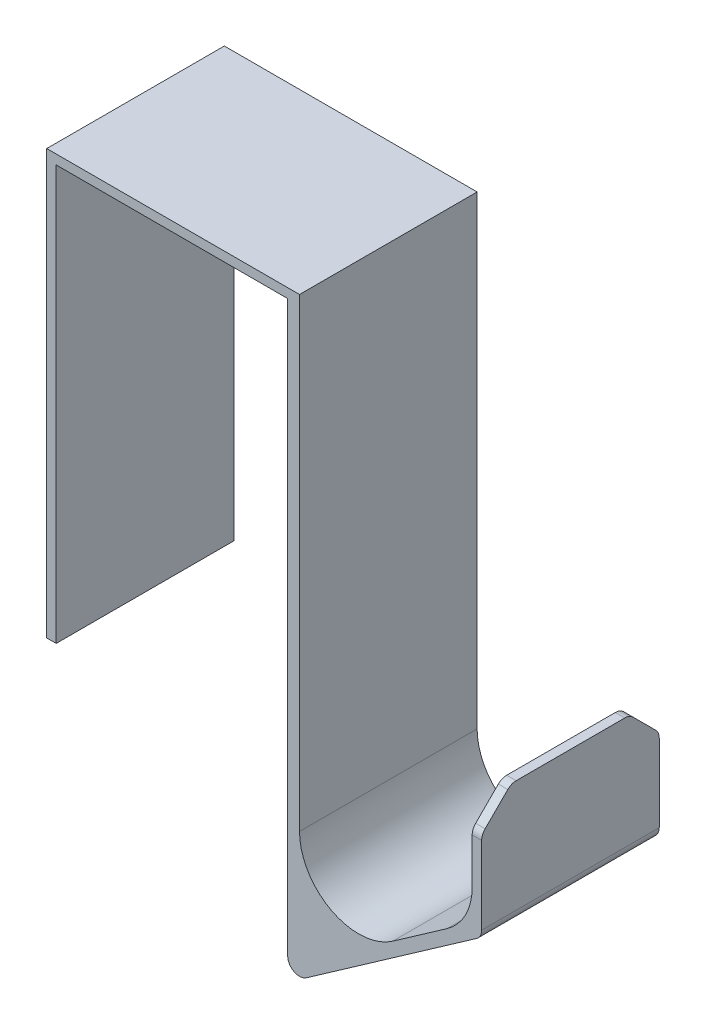
ISO-10303-21;
HEADER;
FILE_DESCRIPTION(('STEP AP214'),'2;1');
FILE_NAME('part.step','',(''),(''),'','','');
FILE_SCHEMA(('AUTOMOTIVE_DESIGN { 1 0 10303 214 1 1 1 1 }'));
ENDSEC;
DATA;
#1=APPLICATION_CONTEXT('core data for automotive mechanical design processes');
#2=APPLICATION_PROTOCOL_DEFINITION('international standard','automotive_design',2000,#1);
#3=PRODUCT_CONTEXT('',#1,'mechanical');
#4=PRODUCT('Part','Part','',(#3));
#5=PRODUCT_RELATED_PRODUCT_CATEGORY('part','',(#4));
#6=PRODUCT_DEFINITION_FORMATION('','',#4);
#7=PRODUCT_DEFINITION_CONTEXT('part definition',#1,'design');
#8=PRODUCT_DEFINITION('design','',#6,#7);
#9=PRODUCT_DEFINITION_SHAPE('','',#8);
#10=(LENGTH_UNIT() NAMED_UNIT(*) SI_UNIT(.MILLI.,.METRE.));
#11=(NAMED_UNIT(*) PLANE_ANGLE_UNIT() SI_UNIT($,.RADIAN.));
#12=(NAMED_UNIT(*) SI_UNIT($,.STERADIAN.) SOLID_ANGLE_UNIT());
#13=UNCERTAINTY_MEASURE_WITH_UNIT(LENGTH_MEASURE(1.E-05),#10,'distance_accuracy_value','');
#14=(GEOMETRIC_REPRESENTATION_CONTEXT(3) GLOBAL_UNCERTAINTY_ASSIGNED_CONTEXT((#13)) GLOBAL_UNIT_ASSIGNED_CONTEXT((#10,
#11,#12)) REPRESENTATION_CONTEXT('',''));
#15=CARTESIAN_POINT('',(0.,0.,0.));
#16=DIRECTION('',(0.,0.,1.));
#17=DIRECTION('',(1.,0.,0.));
#18=AXIS2_PLACEMENT_3D('',#15,#16,#17);
#19=CARTESIAN_POINT('',(-21.15,43.689057372,30.));
#20=DIRECTION('',(0.,1.,0.));
#21=DIRECTION('',(-1.,0.,0.));
#22=AXIS2_PLACEMENT_3D('',#19,#20,#21);
#23=PLANE('',#22);
#24=DIRECTION('',(1.,0.,0.));
#25=VECTOR('',#24,1.);
#26=CARTESIAN_POINT('',(-21.15,43.689057372,0.));
#27=LINE('',#26,#25);
#28=CARTESIAN_POINT('',(-21.15,43.689057372,0.));
#29=VERTEX_POINT('',#28);
#30=CARTESIAN_POINT('',(-19.55,43.689057372,0.));
#31=VERTEX_POINT('',#30);
#32=EDGE_CURVE('E207',#29,#31,#27,.T.);
#33=ORIENTED_EDGE('',*,*,#32,.T.);
#34=DIRECTION('',(0.,0.,-1.));
#35=VECTOR('',#34,1.);
#36=CARTESIAN_POINT('',(-19.55,43.689057372,30.));
#37=LINE('',#36,#35);
#38=CARTESIAN_POINT('',(-19.55,43.689057372,30.));
#39=VERTEX_POINT('',#38);
#40=EDGE_CURVE('E187',#39,#31,#37,.T.);
#41=ORIENTED_EDGE('',*,*,#40,.F.);
#42=DIRECTION('',(1.,0.,0.));
#43=VECTOR('',#42,1.);
#44=CARTESIAN_POINT('',(-21.15,43.689057372,30.));
#45=LINE('',#44,#43);
#46=CARTESIAN_POINT('',(-21.15,43.689057372,30.));
#47=VERTEX_POINT('',#46);
#48=EDGE_CURVE('E194',#47,#39,#45,.T.);
#49=ORIENTED_EDGE('',*,*,#48,.F.);
#50=DIRECTION('',(0.,0.,-1.));
#51=VECTOR('',#50,1.);
#52=CARTESIAN_POINT('',(-21.15,43.689057372,30.));
#53=LINE('',#52,#51);
#54=EDGE_CURVE('E332',#47,#29,#53,.T.);
#55=ORIENTED_EDGE('',*,*,#54,.T.);
#56=EDGE_LOOP('',(#33,#41,#49,#55));
#57=FACE_BOUND('',#56,.T.);
#58=ADVANCED_FACE('F35',(#57),#23,.F.);
#59=CARTESIAN_POINT('',(-19.55,43.689057372,30.));
#60=DIRECTION('',(-1.,0.,0.));
#61=DIRECTION('',(0.,0.,1.));
#62=AXIS2_PLACEMENT_3D('',#59,#60,#61);
#63=PLANE('',#62);
#64=DIRECTION('',(0.,1.,0.));
#65=VECTOR('',#64,1.);
#66=CARTESIAN_POINT('',(-19.55,43.689057372,0.));
#67=LINE('',#66,#65);
#68=CARTESIAN_POINT('',(-19.55,113.689057372,0.));
#69=VERTEX_POINT('',#68);
#70=EDGE_CURVE('E354',#31,#69,#67,.T.);
#71=ORIENTED_EDGE('',*,*,#70,.T.);
#72=DIRECTION('',(0.,0.,-1.));
#73=VECTOR('',#72,1.);
#74=CARTESIAN_POINT('',(-19.55,113.689057372,30.));
#75=LINE('',#74,#73);
#76=CARTESIAN_POINT('',(-19.55,113.689057372,30.));
#77=VERTEX_POINT('',#76);
#78=EDGE_CURVE('E190',#77,#69,#75,.T.);
#79=ORIENTED_EDGE('',*,*,#78,.F.);
#80=DIRECTION('',(0.,1.,0.));
#81=VECTOR('',#80,1.);
#82=CARTESIAN_POINT('',(-19.55,43.689057372,30.));
#83=LINE('',#82,#81);
#84=EDGE_CURVE('E183',#39,#77,#83,.T.);
#85=ORIENTED_EDGE('',*,*,#84,.F.);
#86=ORIENTED_EDGE('',*,*,#40,.T.);
#87=EDGE_LOOP('',(#71,#79,#85,#86));
#88=FACE_BOUND('',#87,.T.);
#89=ADVANCED_FACE('F185',(#88),#63,.F.);
#90=CARTESIAN_POINT('',(-19.55,113.689057372,30.));
#91=DIRECTION('',(0.,1.,0.));
#92=DIRECTION('',(0.,0.,1.));
#93=AXIS2_PLACEMENT_3D('',#90,#91,#92);
#94=PLANE('',#93);
#95=DIRECTION('',(1.,0.,0.));
#96=VECTOR('',#95,1.);
#97=CARTESIAN_POINT('',(-19.55,113.689057372,0.));
#98=LINE('',#97,#96);
#99=CARTESIAN_POINT('',(19.55,113.689057372,0.));
#100=VERTEX_POINT('',#99);
#101=EDGE_CURVE('E353',#69,#100,#98,.T.);
#102=ORIENTED_EDGE('',*,*,#101,.T.);
#103=DIRECTION('',(0.,0.,-1.));
#104=VECTOR('',#103,1.);
#105=CARTESIAN_POINT('',(19.55,113.689057372,30.));
#106=LINE('',#105,#104);
#107=CARTESIAN_POINT('',(19.55,113.689057372,30.));
#108=VERTEX_POINT('',#107);
#109=EDGE_CURVE('E212',#108,#100,#106,.T.);
#110=ORIENTED_EDGE('',*,*,#109,.F.);
#111=DIRECTION('',(1.,0.,0.));
#112=VECTOR('',#111,1.);
#113=CARTESIAN_POINT('',(-19.55,113.689057372,30.));
#114=LINE('',#113,#112);
#115=EDGE_CURVE('E193',#77,#108,#114,.T.);
#116=ORIENTED_EDGE('',*,*,#115,.F.);
#117=ORIENTED_EDGE('',*,*,#78,.T.);
#118=EDGE_LOOP('',(#102,#110,#116,#117));
#119=FACE_BOUND('',#118,.T.);
#120=ADVANCED_FACE('F371',(#119),#94,.F.);
#121=CARTESIAN_POINT('',(19.55,113.689057372,30.));
#122=DIRECTION('',(1.,0.,0.));
#123=DIRECTION('',(0.,0.,-1.));
#124=AXIS2_PLACEMENT_3D('',#121,#122,#123);
#125=PLANE('',#124);
#126=DIRECTION('',(0.,-1.,0.));
#127=VECTOR('',#126,1.);
#128=CARTESIAN_POINT('',(19.55,113.689057372,0.));
#129=LINE('',#128,#127);
#130=CARTESIAN_POINT('',(19.55,17.5310216259423,0.));
#131=VERTEX_POINT('',#130);
#132=EDGE_CURVE('E321',#100,#131,#129,.T.);
#133=ORIENTED_EDGE('',*,*,#132,.T.);
#134=DIRECTION('',(0.,0.,-1.));
#135=VECTOR('',#134,1.);
#136=CARTESIAN_POINT('',(19.55,17.5310216259423,30.));
#137=LINE('',#136,#135);
#138=CARTESIAN_POINT('',(19.55,17.5310216259423,30.));
#139=VERTEX_POINT('',#138);
#140=EDGE_CURVE('E11',#131,#139,#137,.F.);
#141=ORIENTED_EDGE('',*,*,#140,.T.);
#142=DIRECTION('',(0.,-1.,0.));
#143=VECTOR('',#142,1.);
#144=CARTESIAN_POINT('',(19.55,113.689057372,30.));
#145=LINE('',#144,#143);
#146=EDGE_CURVE('E306',#108,#139,#145,.T.);
#147=ORIENTED_EDGE('',*,*,#146,.F.);
#148=ORIENTED_EDGE('',*,*,#109,.T.);
#149=EDGE_LOOP('',(#133,#141,#147,#148));
#150=FACE_BOUND('',#149,.T.);
#151=ADVANCED_FACE('F349',(#150),#125,.F.);
#152=CARTESIAN_POINT('',(19.55,13.689057372,30.));
#153=DIRECTION('',(-0.57357643635105,0.819152044288989,0.));
#154=DIRECTION('',(-0.819152044288989,-0.57357643635105,0.));
#155=AXIS2_PLACEMENT_3D('',#152,#153,#154);
#156=PLANE('',#155);
#157=DIRECTION('',(0.819152044288989,0.57357643635105,0.));
#158=VECTOR('',#157,1.);
#159=CARTESIAN_POINT('',(19.55,13.689057372,0.));
#160=LINE('',#159,#158);
#161=CARTESIAN_POINT('',(22.6971528727021,15.8927175373644,0.));
#162=VERTEX_POINT('',#161);
#163=CARTESIAN_POINT('',(51.4632346442617,36.0349448385675,0.));
#164=VERTEX_POINT('',#163);
#165=EDGE_CURVE('E299',#162,#164,#160,.T.);
#166=ORIENTED_EDGE('',*,*,#165,.T.);
#167=DIRECTION('',(0.,0.,-1.));
#168=VECTOR('',#167,1.);
#169=CARTESIAN_POINT('',(51.4632346442617,36.0349448385675,30.));
#170=LINE('',#169,#168);
#171=CARTESIAN_POINT('',(51.4632346442617,36.0349448385675,30.));
#172=VERTEX_POINT('',#171);
#173=EDGE_CURVE('E43',#164,#172,#170,.F.);
#174=ORIENTED_EDGE('',*,*,#173,.T.);
#175=DIRECTION('',(0.819152044288989,0.57357643635105,0.));
#176=VECTOR('',#175,1.);
#177=CARTESIAN_POINT('',(19.55,13.689057372,30.));
#178=LINE('',#177,#176);
#179=CARTESIAN_POINT('',(22.6971528727021,15.8927175373644,30.));
#180=VERTEX_POINT('',#179);
#181=EDGE_CURVE('E297',#180,#172,#178,.T.);
#182=ORIENTED_EDGE('',*,*,#181,.F.);
#183=DIRECTION('',(0.,0.,-1.));
#184=VECTOR('',#183,1.);
#185=CARTESIAN_POINT('',(22.6971528727021,15.8927175373644,30.));
#186=LINE('',#185,#184);
#187=EDGE_CURVE('E290',#180,#162,#186,.T.);
#188=ORIENTED_EDGE('',*,*,#187,.T.);
#189=EDGE_LOOP('',(#166,#174,#182,#188));
#190=FACE_BOUND('',#189,.T.);
#191=ADVANCED_FACE('F296',(#190),#156,.F.);
#192=CARTESIAN_POINT('',(52.3160817715596,36.632114826042,30.));
#193=DIRECTION('',(-1.,0.,0.));
#194=DIRECTION('',(0.,0.,1.));
#195=AXIS2_PLACEMENT_3D('',#192,#193,#194);
#196=PLANE('',#195);
#197=DIRECTION('',(0.,-0.707106781186546,0.707106781186549));
#198=VECTOR('',#197,1.);
#199=CARTESIAN_POINT('',(52.3160817715596,51.632114826042,30.));
#200=LINE('',#199,#198);
#201=CARTESIAN_POINT('',(52.3160817715596,56.0463283884151,25.5857864376269));
#202=VERTEX_POINT('',#201);
#203=CARTESIAN_POINT('',(52.3160817715596,52.2179012636689,29.4142135623731));
#204=VERTEX_POINT('',#203);
#205=EDGE_CURVE('E239',#202,#204,#200,.T.);
#206=ORIENTED_EDGE('',*,*,#205,.T.);
#207=CARTESIAN_POINT('',(52.3160817715596,50.8036877012958,28.));
#208=DIRECTION('',(-1.,0.,0.));
#209=DIRECTION('',(0.,0.,1.));
#210=AXIS2_PLACEMENT_3D('',#207,#208,#209);
#211=CIRCLE('',#210,2.);
#212=CARTESIAN_POINT('',(52.3160817715596,50.8036877012958,30.));
#213=VERTEX_POINT('',#212);
#214=EDGE_CURVE('E273',#204,#213,#211,.F.);
#215=ORIENTED_EDGE('',*,*,#214,.T.);
#216=DIRECTION('',(0.,1.,0.));
#217=VECTOR('',#216,1.);
#218=CARTESIAN_POINT('',(52.3160817715596,36.632114826042,30.));
#219=LINE('',#218,#217);
#220=CARTESIAN_POINT('',(52.3160817715596,37.6732489271455,30.));
#221=VERTEX_POINT('',#220);
#222=EDGE_CURVE('E305',#221,#213,#219,.T.);
#223=ORIENTED_EDGE('',*,*,#222,.F.);
#224=DIRECTION('',(0.,0.,-1.));
#225=VECTOR('',#224,1.);
#226=CARTESIAN_POINT('',(52.3160817715596,37.6732489271455,30.));
#227=LINE('',#226,#225);
#228=CARTESIAN_POINT('',(52.3160817715596,37.6732489271455,0.));
#229=VERTEX_POINT('',#228);
#230=EDGE_CURVE('E264',#221,#229,#227,.T.);
#231=ORIENTED_EDGE('',*,*,#230,.T.);
#232=DIRECTION('',(0.,1.,0.));
#233=VECTOR('',#232,1.);
#234=CARTESIAN_POINT('',(52.3160817715596,36.632114826042,0.));
#235=LINE('',#234,#233);
#236=CARTESIAN_POINT('',(52.3160817715596,50.8036877012958,0.));
#237=VERTEX_POINT('',#236);
#238=EDGE_CURVE('E313',#229,#237,#235,.T.);
#239=ORIENTED_EDGE('',*,*,#238,.T.);
#240=CARTESIAN_POINT('',(52.3160817715596,50.8036877012958,2.));
#241=DIRECTION('',(-1.,0.,0.));
#242=DIRECTION('',(0.,0.,1.));
#243=AXIS2_PLACEMENT_3D('',#240,#241,#242);
#244=CIRCLE('',#243,2.);
#245=CARTESIAN_POINT('',(52.3160817715596,52.2179012636689,0.585786437626903));
#246=VERTEX_POINT('',#245);
#247=EDGE_CURVE('E271',#237,#246,#244,.F.);
#248=ORIENTED_EDGE('',*,*,#247,.T.);
#249=DIRECTION('',(0.,-0.707106781186549,-0.707106781186547));
#250=VECTOR('',#249,1.);
#251=CARTESIAN_POINT('',(52.3160817715596,56.632114826042,4.99999999999999));
#252=LINE('',#251,#250);
#253=CARTESIAN_POINT('',(52.3160817715596,56.0463283884151,4.41421356237308));
#254=VERTEX_POINT('',#253);
#255=EDGE_CURVE('E242',#246,#254,#252,.F.);
#256=ORIENTED_EDGE('',*,*,#255,.T.);
#257=CARTESIAN_POINT('',(52.3160817715596,54.632114826042,5.82842712474618));
#258=DIRECTION('',(-1.,0.,0.));
#259=DIRECTION('',(0.,0.,1.));
#260=AXIS2_PLACEMENT_3D('',#257,#258,#259);
#261=CIRCLE('',#260,2.);
#262=CARTESIAN_POINT('',(52.3160817715596,56.632114826042,5.82842712474618));
#263=VERTEX_POINT('',#262);
#264=EDGE_CURVE('E269',#254,#263,#261,.F.);
#265=ORIENTED_EDGE('',*,*,#264,.T.);
#266=DIRECTION('',(0.,0.,-1.));
#267=VECTOR('',#266,1.);
#268=CARTESIAN_POINT('',(52.3160817715596,56.632114826042,30.));
#269=LINE('',#268,#267);
#270=CARTESIAN_POINT('',(52.3160817715596,56.632114826042,24.1715728752538));
#271=VERTEX_POINT('',#270);
#272=EDGE_CURVE('E343',#271,#263,#269,.T.);
#273=ORIENTED_EDGE('',*,*,#272,.F.);
#274=CARTESIAN_POINT('',(52.3160817715596,54.632114826042,24.1715728752538));
#275=DIRECTION('',(-1.,0.,0.));
#276=DIRECTION('',(0.,0.,1.));
#277=AXIS2_PLACEMENT_3D('',#274,#275,#276);
#278=CIRCLE('',#277,2.);
#279=EDGE_CURVE('E267',#271,#202,#278,.F.);
#280=ORIENTED_EDGE('',*,*,#279,.T.);
#281=EDGE_LOOP('',(#206,#215,#223,#231,#239,#248,#256,#265,#273,#280));
#282=FACE_BOUND('',#281,.T.);
#283=ADVANCED_FACE('F312',(#282),#196,.F.);
#284=CARTESIAN_POINT('',(50.7160817715596,56.632114826042,30.));
#285=DIRECTION('',(0.,-1.,0.));
#286=DIRECTION('',(0.,0.,-1.));
#287=AXIS2_PLACEMENT_3D('',#284,#285,#286);
#288=PLANE('',#287);
#289=ORIENTED_EDGE('',*,*,#272,.T.);
#290=DIRECTION('',(1.,0.,0.));
#291=VECTOR('',#290,1.);
#292=CARTESIAN_POINT('',(50.7160817715596,56.632114826042,5.82842712474618));
#293=LINE('',#292,#291);
#294=CARTESIAN_POINT('',(50.7160817715596,56.632114826042,5.82842712474618));
#295=VERTEX_POINT('',#294);
#296=EDGE_CURVE('E287',#263,#295,#293,.F.);
#297=ORIENTED_EDGE('',*,*,#296,.T.);
#298=DIRECTION('',(0.,0.,-1.));
#299=VECTOR('',#298,1.);
#300=CARTESIAN_POINT('',(50.7160817715596,56.632114826042,30.));
#301=LINE('',#300,#299);
#302=CARTESIAN_POINT('',(50.7160817715596,56.632114826042,24.1715728752538));
#303=VERTEX_POINT('',#302);
#304=EDGE_CURVE('E340',#303,#295,#301,.T.);
#305=ORIENTED_EDGE('',*,*,#304,.F.);
#306=DIRECTION('',(1.,0.,0.));
#307=VECTOR('',#306,1.);
#308=CARTESIAN_POINT('',(52.3160817715596,56.632114826042,24.1715728752538));
#309=LINE('',#308,#307);
#310=EDGE_CURVE('E284',#303,#271,#309,.T.);
#311=ORIENTED_EDGE('',*,*,#310,.T.);
#312=EDGE_LOOP('',(#289,#297,#305,#311));
#313=FACE_BOUND('',#312,.T.);
#314=ADVANCED_FACE('F501',(#313),#288,.F.);
#315=CARTESIAN_POINT('',(50.7160817715596,37.9533319424294,30.));
#316=DIRECTION('',(1.,0.,0.));
#317=DIRECTION('',(0.,0.,-1.));
#318=AXIS2_PLACEMENT_3D('',#315,#316,#317);
#319=PLANE('',#318);
#320=DIRECTION('',(0.,-1.,0.));
#321=VECTOR('',#320,1.);
#322=CARTESIAN_POINT('',(50.7160817715596,37.9533319424294,30.));
#323=LINE('',#322,#321);
#324=CARTESIAN_POINT('',(50.7160817715596,50.8036877012958,30.));
#325=VERTEX_POINT('',#324);
#326=CARTESIAN_POINT('',(50.7160817715596,43.1590024479468,30.));
#327=VERTEX_POINT('',#326);
#328=EDGE_CURVE('E367',#325,#327,#323,.T.);
#329=ORIENTED_EDGE('',*,*,#328,.F.);
#330=CARTESIAN_POINT('',(50.7160817715596,50.8036877012958,28.));
#331=DIRECTION('',(1.,0.,0.));
#332=DIRECTION('',(0.,0.,-1.));
#333=AXIS2_PLACEMENT_3D('',#330,#331,#332);
#334=CIRCLE('',#333,2.);
#335=CARTESIAN_POINT('',(50.7160817715596,52.2179012636689,29.4142135623731));
#336=VERTEX_POINT('',#335);
#337=EDGE_CURVE('E258',#325,#336,#334,.F.);
#338=ORIENTED_EDGE('',*,*,#337,.T.);
#339=DIRECTION('',(0.,0.707106781186546,-0.707106781186549));
#340=VECTOR('',#339,1.);
#341=CARTESIAN_POINT('',(50.7160817715596,51.632114826042,30.));
#342=LINE('',#341,#340);
#343=CARTESIAN_POINT('',(50.7160817715596,56.0463283884151,25.5857864376269));
#344=VERTEX_POINT('',#343);
#345=EDGE_CURVE('E233',#336,#344,#342,.T.);
#346=ORIENTED_EDGE('',*,*,#345,.T.);
#347=CARTESIAN_POINT('',(50.7160817715596,54.632114826042,24.1715728752538));
#348=DIRECTION('',(1.,0.,0.));
#349=DIRECTION('',(0.,0.,-1.));
#350=AXIS2_PLACEMENT_3D('',#347,#348,#349);
#351=CIRCLE('',#350,2.);
#352=EDGE_CURVE('E252',#344,#303,#351,.F.);
#353=ORIENTED_EDGE('',*,*,#352,.T.);
#354=ORIENTED_EDGE('',*,*,#304,.T.);
#355=CARTESIAN_POINT('',(50.7160817715596,54.632114826042,5.82842712474618));
#356=DIRECTION('',(1.,0.,0.));
#357=DIRECTION('',(0.,0.,-1.));
#358=AXIS2_PLACEMENT_3D('',#355,#356,#357);
#359=CIRCLE('',#358,2.);
#360=CARTESIAN_POINT('',(50.7160817715596,56.0463283884151,4.41421356237308));
#361=VERTEX_POINT('',#360);
#362=EDGE_CURVE('E254',#295,#361,#359,.F.);
#363=ORIENTED_EDGE('',*,*,#362,.T.);
#364=DIRECTION('',(0.,0.707106781186549,0.707106781186547));
#365=VECTOR('',#364,1.);
#366=CARTESIAN_POINT('',(50.7160817715596,56.632114826042,4.99999999999999));
#367=LINE('',#366,#365);
#368=CARTESIAN_POINT('',(50.7160817715596,52.2179012636689,0.585786437626903));
#369=VERTEX_POINT('',#368);
#370=EDGE_CURVE('E236',#361,#369,#367,.F.);
#371=ORIENTED_EDGE('',*,*,#370,.T.);
#372=CARTESIAN_POINT('',(50.7160817715596,50.8036877012958,2.));
#373=DIRECTION('',(1.,0.,0.));
#374=DIRECTION('',(0.,0.,-1.));
#375=AXIS2_PLACEMENT_3D('',#372,#373,#374);
#376=CIRCLE('',#375,2.);
#377=CARTESIAN_POINT('',(50.7160817715596,50.8036877012958,0.));
#378=VERTEX_POINT('',#377);
#379=EDGE_CURVE('E256',#369,#378,#376,.F.);
#380=ORIENTED_EDGE('',*,*,#379,.T.);
#381=DIRECTION('',(0.,-1.,0.));
#382=VECTOR('',#381,1.);
#383=CARTESIAN_POINT('',(50.7160817715596,37.9533319424294,0.));
#384=LINE('',#383,#382);
#385=CARTESIAN_POINT('',(50.7160817715596,43.1590024479468,0.));
#386=VERTEX_POINT('',#385);
#387=EDGE_CURVE('E317',#378,#386,#384,.T.);
#388=ORIENTED_EDGE('',*,*,#387,.T.);
#389=DIRECTION('',(0.,0.,-1.));
#390=VECTOR('',#389,1.);
#391=CARTESIAN_POINT('',(50.7160817715596,43.1590024479468,30.));
#392=LINE('',#391,#390);
#393=EDGE_CURVE('E218',#386,#327,#392,.F.);
#394=ORIENTED_EDGE('',*,*,#393,.T.);
#395=EDGE_LOOP('',(#329,#338,#346,#353,#354,#363,#371,#380,#388,#394));
#396=FACE_BOUND('',#395,.T.);
#397=ADVANCED_FACE('F495',(#396),#319,.F.);
#398=CARTESIAN_POINT('',(21.55,17.5310216259423,30.));
#399=DIRECTION('',(0.57357643635105,-0.819152044288989,0.));
#400=DIRECTION('',(0.819152044288989,0.57357643635105,0.));
#401=AXIS2_PLACEMENT_3D('',#398,#399,#400);
#402=PLANE('',#401);
#403=DIRECTION('',(-0.819152044288989,-0.57357643635105,0.));
#404=VECTOR('',#403,1.);
#405=CARTESIAN_POINT('',(21.55,17.5310216259423,30.));
#406=LINE('',#405,#404);
#407=CARTESIAN_POINT('',(46.4518461350701,34.9674820050569,30.));
#408=VERTEX_POINT('',#407);
#409=CARTESIAN_POINT('',(37.2857643635105,28.5493224527642,30.));
#410=VERTEX_POINT('',#409);
#411=EDGE_CURVE('E364',#408,#410,#406,.T.);
#412=ORIENTED_EDGE('',*,*,#411,.F.);
#413=DIRECTION('',(0.,0.,-1.));
#414=VECTOR('',#413,1.);
#415=CARTESIAN_POINT('',(46.4518461350701,34.9674820050569,0.));
#416=LINE('',#415,#414);
#417=CARTESIAN_POINT('',(46.4518461350701,34.9674820050569,0.));
#418=VERTEX_POINT('',#417);
#419=EDGE_CURVE('E210',#408,#418,#416,.T.);
#420=ORIENTED_EDGE('',*,*,#419,.T.);
#421=DIRECTION('',(-0.819152044288989,-0.57357643635105,0.));
#422=VECTOR('',#421,1.);
#423=CARTESIAN_POINT('',(21.55,17.5310216259423,0.));
#424=LINE('',#423,#422);
#425=CARTESIAN_POINT('',(37.2857643635105,28.5493224527642,0.));
#426=VERTEX_POINT('',#425);
#427=EDGE_CURVE('E319',#418,#426,#424,.T.);
#428=ORIENTED_EDGE('',*,*,#427,.T.);
#429=DIRECTION('',(0.,0.,-1.));
#430=VECTOR('',#429,1.);
#431=CARTESIAN_POINT('',(37.2857643635105,28.5493224527642,30.));
#432=LINE('',#431,#430);
#433=EDGE_CURVE('E208',#426,#410,#432,.F.);
#434=ORIENTED_EDGE('',*,*,#433,.T.);
#435=EDGE_LOOP('',(#412,#420,#428,#434));
#436=FACE_BOUND('',#435,.T.);
#437=ADVANCED_FACE('F500',(#436),#402,.F.);
#438=CARTESIAN_POINT('',(21.55,115.289057372,30.));
#439=DIRECTION('',(-1.,0.,0.));
#440=DIRECTION('',(0.,-1.,0.));
#441=AXIS2_PLACEMENT_3D('',#438,#439,#440);
#442=PLANE('',#441);
#443=DIRECTION('',(0.,1.,0.));
#444=VECTOR('',#443,1.);
#445=CARTESIAN_POINT('',(21.55,115.289057372,30.));
#446=LINE('',#445,#444);
#447=CARTESIAN_POINT('',(21.55,36.7408428956541,30.));
#448=VERTEX_POINT('',#447);
#449=CARTESIAN_POINT('',(21.55,115.289057372,30.));
#450=VERTEX_POINT('',#449);
#451=EDGE_CURVE('E362',#448,#450,#446,.T.);
#452=ORIENTED_EDGE('',*,*,#451,.F.);
#453=DIRECTION('',(0.,0.,-1.));
#454=VECTOR('',#453,1.);
#455=CARTESIAN_POINT('',(21.55,36.7408428956541,0.));
#456=LINE('',#455,#454);
#457=CARTESIAN_POINT('',(21.55,36.7408428956541,0.));
#458=VERTEX_POINT('',#457);
#459=EDGE_CURVE('E221',#448,#458,#456,.T.);
#460=ORIENTED_EDGE('',*,*,#459,.T.);
#461=DIRECTION('',(0.,1.,0.));
#462=VECTOR('',#461,1.);
#463=CARTESIAN_POINT('',(21.55,115.289057372,0.));
#464=LINE('',#463,#462);
#465=CARTESIAN_POINT('',(21.55,115.289057372,0.));
#466=VERTEX_POINT('',#465);
#467=EDGE_CURVE('E327',#458,#466,#464,.T.);
#468=ORIENTED_EDGE('',*,*,#467,.T.);
#469=DIRECTION('',(0.,0.,-1.));
#470=VECTOR('',#469,1.);
#471=CARTESIAN_POINT('',(21.55,115.289057372,30.));
#472=LINE('',#471,#470);
#473=EDGE_CURVE('E337',#450,#466,#472,.T.);
#474=ORIENTED_EDGE('',*,*,#473,.F.);
#475=EDGE_LOOP('',(#452,#460,#468,#474));
#476=FACE_BOUND('',#475,.T.);
#477=ADVANCED_FACE('F551',(#476),#442,.F.);
#478=CARTESIAN_POINT('',(-21.15,115.289057372,30.));
#479=DIRECTION('',(0.,-1.,0.));
#480=DIRECTION('',(0.,0.,-1.));
#481=AXIS2_PLACEMENT_3D('',#478,#479,#480);
#482=PLANE('',#481);
#483=DIRECTION('',(-1.,0.,0.));
#484=VECTOR('',#483,1.);
#485=CARTESIAN_POINT('',(-21.15,115.289057372,0.));
#486=LINE('',#485,#484);
#487=CARTESIAN_POINT('',(-21.15,115.289057372,0.));
#488=VERTEX_POINT('',#487);
#489=EDGE_CURVE('E329',#466,#488,#486,.T.);
#490=ORIENTED_EDGE('',*,*,#489,.T.);
#491=DIRECTION('',(0.,0.,-1.));
#492=VECTOR('',#491,1.);
#493=CARTESIAN_POINT('',(-21.15,115.289057372,30.));
#494=LINE('',#493,#492);
#495=CARTESIAN_POINT('',(-21.15,115.289057372,30.));
#496=VERTEX_POINT('',#495);
#497=EDGE_CURVE('E334',#496,#488,#494,.T.);
#498=ORIENTED_EDGE('',*,*,#497,.F.);
#499=DIRECTION('',(-1.,0.,0.));
#500=VECTOR('',#499,1.);
#501=CARTESIAN_POINT('',(-21.15,115.289057372,30.));
#502=LINE('',#501,#500);
#503=EDGE_CURVE('E360',#450,#496,#502,.T.);
#504=ORIENTED_EDGE('',*,*,#503,.F.);
#505=ORIENTED_EDGE('',*,*,#473,.T.);
#506=EDGE_LOOP('',(#490,#498,#504,#505));
#507=FACE_BOUND('',#506,.T.);
#508=ADVANCED_FACE('F556',(#507),#482,.F.);
#509=CARTESIAN_POINT('',(-21.15,43.689057372,30.));
#510=DIRECTION('',(1.,0.,0.));
#511=DIRECTION('',(0.,0.,-1.));
#512=AXIS2_PLACEMENT_3D('',#509,#510,#511);
#513=PLANE('',#512);
#514=DIRECTION('',(0.,-1.,0.));
#515=VECTOR('',#514,1.);
#516=CARTESIAN_POINT('',(-21.15,43.689057372,0.));
#517=LINE('',#516,#515);
#518=EDGE_CURVE('E204',#488,#29,#517,.T.);
#519=ORIENTED_EDGE('',*,*,#518,.T.);
#520=ORIENTED_EDGE('',*,*,#54,.F.);
#521=DIRECTION('',(0.,-1.,0.));
#522=VECTOR('',#521,1.);
#523=CARTESIAN_POINT('',(-21.15,43.689057372,30.));
#524=LINE('',#523,#522);
#525=EDGE_CURVE('E200',#496,#47,#524,.T.);
#526=ORIENTED_EDGE('',*,*,#525,.F.);
#527=ORIENTED_EDGE('',*,*,#497,.T.);
#528=EDGE_LOOP('',(#519,#520,#526,#527));
#529=FACE_BOUND('',#528,.T.);
#530=ADVANCED_FACE('F488',(#529),#513,.F.);
#531=CARTESIAN_POINT('',(0.,0.,30.));
#532=DIRECTION('',(0.,0.,1.));
#533=DIRECTION('',(1.,0.,0.));
#534=AXIS2_PLACEMENT_3D('',#531,#532,#533);
#535=PLANE('',#534);
#536=ORIENTED_EDGE('',*,*,#222,.T.);
#537=DIRECTION('',(-1.,0.,0.));
#538=VECTOR('',#537,1.);
#539=CARTESIAN_POINT('',(0.,50.8036877012958,30.));
#540=LINE('',#539,#538);
#541=EDGE_CURVE('E249',#213,#325,#540,.T.);
#542=ORIENTED_EDGE('',*,*,#541,.T.);
#543=ORIENTED_EDGE('',*,*,#328,.T.);
#544=CARTESIAN_POINT('',(40.7160817715596,43.1590024479468,30.));
#545=DIRECTION('',(0.,0.,1.));
#546=DIRECTION('',(1.,0.,0.));
#547=AXIS2_PLACEMENT_3D('',#544,#545,#546);
#548=CIRCLE('',#547,10.);
#549=EDGE_CURVE('E227',#327,#408,#548,.F.);
#550=ORIENTED_EDGE('',*,*,#549,.T.);
#551=ORIENTED_EDGE('',*,*,#411,.T.);
#552=CARTESIAN_POINT('',(31.55,36.7408428956541,30.));
#553=DIRECTION('',(0.,0.,1.));
#554=DIRECTION('',(1.,0.,0.));
#555=AXIS2_PLACEMENT_3D('',#552,#553,#554);
#556=CIRCLE('',#555,10.);
#557=EDGE_CURVE('E231',#410,#448,#556,.F.);
#558=ORIENTED_EDGE('',*,*,#557,.T.);
#559=ORIENTED_EDGE('',*,*,#451,.T.);
#560=ORIENTED_EDGE('',*,*,#503,.T.);
#561=ORIENTED_EDGE('',*,*,#525,.T.);
#562=ORIENTED_EDGE('',*,*,#48,.T.);
#563=ORIENTED_EDGE('',*,*,#84,.T.);
#564=ORIENTED_EDGE('',*,*,#115,.T.);
#565=ORIENTED_EDGE('',*,*,#146,.T.);
#566=CARTESIAN_POINT('',(21.55,17.5310216259423,30.));
#567=DIRECTION('',(0.,0.,1.));
#568=DIRECTION('',(1.,0.,0.));
#569=AXIS2_PLACEMENT_3D('',#566,#567,#568);
#570=CIRCLE('',#569,2.);
#571=EDGE_CURVE('E245',#139,#180,#570,.T.);
#572=ORIENTED_EDGE('',*,*,#571,.T.);
#573=ORIENTED_EDGE('',*,*,#181,.T.);
#574=CARTESIAN_POINT('',(50.3160817715596,37.6732489271455,30.));
#575=DIRECTION('',(0.,0.,1.));
#576=DIRECTION('',(1.,0.,0.));
#577=AXIS2_PLACEMENT_3D('',#574,#575,#576);
#578=CIRCLE('',#577,2.);
#579=EDGE_CURVE('E247',#172,#221,#578,.T.);
#580=ORIENTED_EDGE('',*,*,#579,.T.);
#581=EDGE_LOOP('',(#536,#542,#543,#550,#551,#558,#559,#560,#561,#562,#563,#564,#565,#572,#573,#580));
#582=FACE_BOUND('',#581,.T.);
#583=ADVANCED_FACE('F198',(#582),#535,.T.);
#584=CARTESIAN_POINT('',(0.,0.,0.));
#585=DIRECTION('',(0.,0.,1.));
#586=DIRECTION('',(1.,0.,0.));
#587=AXIS2_PLACEMENT_3D('',#584,#585,#586);
#588=PLANE('',#587);
#589=ORIENTED_EDGE('',*,*,#387,.F.);
#590=DIRECTION('',(-1.,0.,0.));
#591=VECTOR('',#590,1.);
#592=CARTESIAN_POINT('',(52.3160817715596,50.8036877012958,0.));
#593=LINE('',#592,#591);
#594=EDGE_CURVE('E277',#378,#237,#593,.F.);
#595=ORIENTED_EDGE('',*,*,#594,.T.);
#596=ORIENTED_EDGE('',*,*,#238,.F.);
#597=CARTESIAN_POINT('',(50.3160817715596,37.6732489271455,0.));
#598=DIRECTION('',(0.,0.,1.));
#599=DIRECTION('',(1.,0.,0.));
#600=AXIS2_PLACEMENT_3D('',#597,#598,#599);
#601=CIRCLE('',#600,2.);
#602=EDGE_CURVE('E56',#229,#164,#601,.F.);
#603=ORIENTED_EDGE('',*,*,#602,.T.);
#604=ORIENTED_EDGE('',*,*,#165,.F.);
#605=CARTESIAN_POINT('',(21.55,17.5310216259423,0.));
#606=DIRECTION('',(0.,0.,1.));
#607=DIRECTION('',(1.,0.,0.));
#608=AXIS2_PLACEMENT_3D('',#605,#606,#607);
#609=CIRCLE('',#608,2.);
#610=EDGE_CURVE('E50',#162,#131,#609,.F.);
#611=ORIENTED_EDGE('',*,*,#610,.T.);
#612=ORIENTED_EDGE('',*,*,#132,.F.);
#613=ORIENTED_EDGE('',*,*,#101,.F.);
#614=ORIENTED_EDGE('',*,*,#70,.F.);
#615=ORIENTED_EDGE('',*,*,#32,.F.);
#616=ORIENTED_EDGE('',*,*,#518,.F.);
#617=ORIENTED_EDGE('',*,*,#489,.F.);
#618=ORIENTED_EDGE('',*,*,#467,.F.);
#619=CARTESIAN_POINT('',(31.55,36.7408428956541,0.));
#620=DIRECTION('',(0.,0.,1.));
#621=DIRECTION('',(1.,0.,0.));
#622=AXIS2_PLACEMENT_3D('',#619,#620,#621);
#623=CIRCLE('',#622,10.);
#624=EDGE_CURVE('E229',#458,#426,#623,.T.);
#625=ORIENTED_EDGE('',*,*,#624,.T.);
#626=ORIENTED_EDGE('',*,*,#427,.F.);
#627=CARTESIAN_POINT('',(40.7160817715596,43.1590024479468,0.));
#628=DIRECTION('',(0.,0.,1.));
#629=DIRECTION('',(1.,0.,0.));
#630=AXIS2_PLACEMENT_3D('',#627,#628,#629);
#631=CIRCLE('',#630,10.);
#632=EDGE_CURVE('E224',#418,#386,#631,.T.);
#633=ORIENTED_EDGE('',*,*,#632,.T.);
#634=EDGE_LOOP('',(#589,#595,#596,#603,#604,#611,#612,#613,#614,#615,#616,#617,#618,#625,#626,#633));
#635=FACE_BOUND('',#634,.T.);
#636=ADVANCED_FACE('F315',(#635),#588,.F.);
#637=CARTESIAN_POINT('',(40.7160817715596,43.1590024479468,30.));
#638=DIRECTION('',(0.,0.,1.));
#639=DIRECTION('',(1.,0.,0.));
#640=AXIS2_PLACEMENT_3D('',#637,#638,#639);
#641=CYLINDRICAL_SURFACE('',#640,10.);
#642=ORIENTED_EDGE('',*,*,#549,.F.);
#643=ORIENTED_EDGE('',*,*,#393,.F.);
#644=ORIENTED_EDGE('',*,*,#632,.F.);
#645=ORIENTED_EDGE('',*,*,#419,.F.);
#646=EDGE_LOOP('',(#642,#643,#644,#645));
#647=FACE_BOUND('',#646,.T.);
#648=ADVANCED_FACE('F385',(#647),#641,.F.);
#649=CARTESIAN_POINT('',(31.55,36.7408428956541,30.));
#650=DIRECTION('',(0.,0.,1.));
#651=DIRECTION('',(1.,0.,0.));
#652=AXIS2_PLACEMENT_3D('',#649,#650,#651);
#653=CYLINDRICAL_SURFACE('',#652,10.);
#654=ORIENTED_EDGE('',*,*,#557,.F.);
#655=ORIENTED_EDGE('',*,*,#433,.F.);
#656=ORIENTED_EDGE('',*,*,#624,.F.);
#657=ORIENTED_EDGE('',*,*,#459,.F.);
#658=EDGE_LOOP('',(#654,#655,#656,#657));
#659=FACE_BOUND('',#658,.T.);
#660=ADVANCED_FACE('F388',(#659),#653,.F.);
#661=CARTESIAN_POINT('',(50.7160817715596,56.632114826042,4.99999999999999));
#662=DIRECTION('',(0.,-0.707106781186546,0.707106781186548));
#663=DIRECTION('',(-1.,0.,0.));
#664=AXIS2_PLACEMENT_3D('',#661,#662,#663);
#665=PLANE('',#664);
#666=ORIENTED_EDGE('',*,*,#255,.F.);
#667=DIRECTION('',(1.,0.,0.));
#668=VECTOR('',#667,1.);
#669=CARTESIAN_POINT('',(50.7160817715596,52.2179012636689,0.585786437626905));
#670=LINE('',#669,#668);
#671=EDGE_CURVE('E282',#246,#369,#670,.F.);
#672=ORIENTED_EDGE('',*,*,#671,.T.);
#673=ORIENTED_EDGE('',*,*,#370,.F.);
#674=DIRECTION('',(-1.,0.,0.));
#675=VECTOR('',#674,1.);
#676=CARTESIAN_POINT('',(52.3160817715596,56.0463283884151,4.41421356237308));
#677=LINE('',#676,#675);
#678=EDGE_CURVE('E280',#361,#254,#677,.F.);
#679=ORIENTED_EDGE('',*,*,#678,.T.);
#680=EDGE_LOOP('',(#666,#672,#673,#679));
#681=FACE_BOUND('',#680,.T.);
#682=ADVANCED_FACE('F392',(#681),#665,.F.);
#683=CARTESIAN_POINT('',(0.,51.632114826042,30.));
#684=DIRECTION('',(0.,0.707106781186549,0.707106781186545));
#685=DIRECTION('',(1.,0.,0.));
#686=AXIS2_PLACEMENT_3D('',#683,#684,#685);
#687=PLANE('',#686);
#688=ORIENTED_EDGE('',*,*,#345,.F.);
#689=DIRECTION('',(-1.,0.,0.));
#690=VECTOR('',#689,1.);
#691=CARTESIAN_POINT('',(0.,52.2179012636689,29.4142135623731));
#692=LINE('',#691,#690);
#693=EDGE_CURVE('E262',#336,#204,#692,.F.);
#694=ORIENTED_EDGE('',*,*,#693,.T.);
#695=ORIENTED_EDGE('',*,*,#205,.F.);
#696=DIRECTION('',(1.,0.,0.));
#697=VECTOR('',#696,1.);
#698=CARTESIAN_POINT('',(50.7160817715596,56.0463283884151,25.5857864376269));
#699=LINE('',#698,#697);
#700=EDGE_CURVE('E260',#202,#344,#699,.F.);
#701=ORIENTED_EDGE('',*,*,#700,.T.);
#702=EDGE_LOOP('',(#688,#694,#695,#701));
#703=FACE_BOUND('',#702,.T.);
#704=ADVANCED_FACE('F400',(#703),#687,.T.);
#705=CARTESIAN_POINT('',(0.,50.8036877012958,28.));
#706=DIRECTION('',(-1.,0.,0.));
#707=DIRECTION('',(0.,0.,1.));
#708=AXIS2_PLACEMENT_3D('',#705,#706,#707);
#709=CYLINDRICAL_SURFACE('',#708,2.);
#710=ORIENTED_EDGE('',*,*,#214,.F.);
#711=ORIENTED_EDGE('',*,*,#693,.F.);
#712=ORIENTED_EDGE('',*,*,#337,.F.);
#713=ORIENTED_EDGE('',*,*,#541,.F.);
#714=EDGE_LOOP('',(#710,#711,#712,#713));
#715=FACE_BOUND('',#714,.T.);
#716=ADVANCED_FACE('F406',(#715),#709,.T.);
#717=CARTESIAN_POINT('',(0.,50.8036877012958,2.));
#718=DIRECTION('',(1.,0.,0.));
#719=DIRECTION('',(0.,0.,-1.));
#720=AXIS2_PLACEMENT_3D('',#717,#718,#719);
#721=CYLINDRICAL_SURFACE('',#720,2.);
#722=ORIENTED_EDGE('',*,*,#379,.F.);
#723=ORIENTED_EDGE('',*,*,#671,.F.);
#724=ORIENTED_EDGE('',*,*,#247,.F.);
#725=ORIENTED_EDGE('',*,*,#594,.F.);
#726=EDGE_LOOP('',(#722,#723,#724,#725));
#727=FACE_BOUND('',#726,.T.);
#728=ADVANCED_FACE('F410',(#727),#721,.T.);
#729=CARTESIAN_POINT('',(50.7160817715596,54.632114826042,5.82842712474618));
#730=DIRECTION('',(-1.,0.,0.));
#731=DIRECTION('',(0.,0.,1.));
#732=AXIS2_PLACEMENT_3D('',#729,#730,#731);
#733=CYLINDRICAL_SURFACE('',#732,2.);
#734=ORIENTED_EDGE('',*,*,#264,.F.);
#735=ORIENTED_EDGE('',*,*,#678,.F.);
#736=ORIENTED_EDGE('',*,*,#362,.F.);
#737=ORIENTED_EDGE('',*,*,#296,.F.);
#738=EDGE_LOOP('',(#734,#735,#736,#737));
#739=FACE_BOUND('',#738,.T.);
#740=ADVANCED_FACE('F414',(#739),#733,.T.);
#741=CARTESIAN_POINT('',(50.7160817715596,54.632114826042,24.1715728752538));
#742=DIRECTION('',(-1.,0.,0.));
#743=DIRECTION('',(0.,0.,1.));
#744=AXIS2_PLACEMENT_3D('',#741,#742,#743);
#745=CYLINDRICAL_SURFACE('',#744,2.);
#746=ORIENTED_EDGE('',*,*,#352,.F.);
#747=ORIENTED_EDGE('',*,*,#700,.F.);
#748=ORIENTED_EDGE('',*,*,#279,.F.);
#749=ORIENTED_EDGE('',*,*,#310,.F.);
#750=EDGE_LOOP('',(#746,#747,#748,#749));
#751=FACE_BOUND('',#750,.T.);
#752=ADVANCED_FACE('F418',(#751),#745,.T.);
#753=CARTESIAN_POINT('',(50.3160817715596,37.6732489271455,30.));
#754=DIRECTION('',(0.,0.,-1.));
#755=DIRECTION('',(-1.,0.,0.));
#756=AXIS2_PLACEMENT_3D('',#753,#754,#755);
#757=CYLINDRICAL_SURFACE('',#756,2.);
#758=ORIENTED_EDGE('',*,*,#579,.F.);
#759=ORIENTED_EDGE('',*,*,#173,.F.);
#760=ORIENTED_EDGE('',*,*,#602,.F.);
#761=ORIENTED_EDGE('',*,*,#230,.F.);
#762=EDGE_LOOP('',(#758,#759,#760,#761));
#763=FACE_BOUND('',#762,.T.);
#764=ADVANCED_FACE('F309',(#763),#757,.T.);
#765=CARTESIAN_POINT('',(21.55,17.5310216259423,30.));
#766=DIRECTION('',(0.,0.,-1.));
#767=DIRECTION('',(-1.,0.,0.));
#768=AXIS2_PLACEMENT_3D('',#765,#766,#767);
#769=CYLINDRICAL_SURFACE('',#768,2.);
#770=ORIENTED_EDGE('',*,*,#571,.F.);
#771=ORIENTED_EDGE('',*,*,#140,.F.);
#772=ORIENTED_EDGE('',*,*,#610,.F.);
#773=ORIENTED_EDGE('',*,*,#187,.F.);
#774=EDGE_LOOP('',(#770,#771,#772,#773));
#775=FACE_BOUND('',#774,.T.);
#776=ADVANCED_FACE('F37',(#775),#769,.T.);
#777=CLOSED_SHELL('',(#58,#89,#120,#151,#191,#283,#314,#397,#437,#477,#508,#530,#583,#636,#648,
#660,#682,#704,#716,#728,#740,#752,#764,#776));
#778=MANIFOLD_SOLID_BREP('B2',#777);
#779=ADVANCED_BREP_SHAPE_REPRESENTATION('',(#18,#778),#14);
#780=SHAPE_DEFINITION_REPRESENTATION(#9,#779);
ENDSEC;
END-ISO-10303-21;
